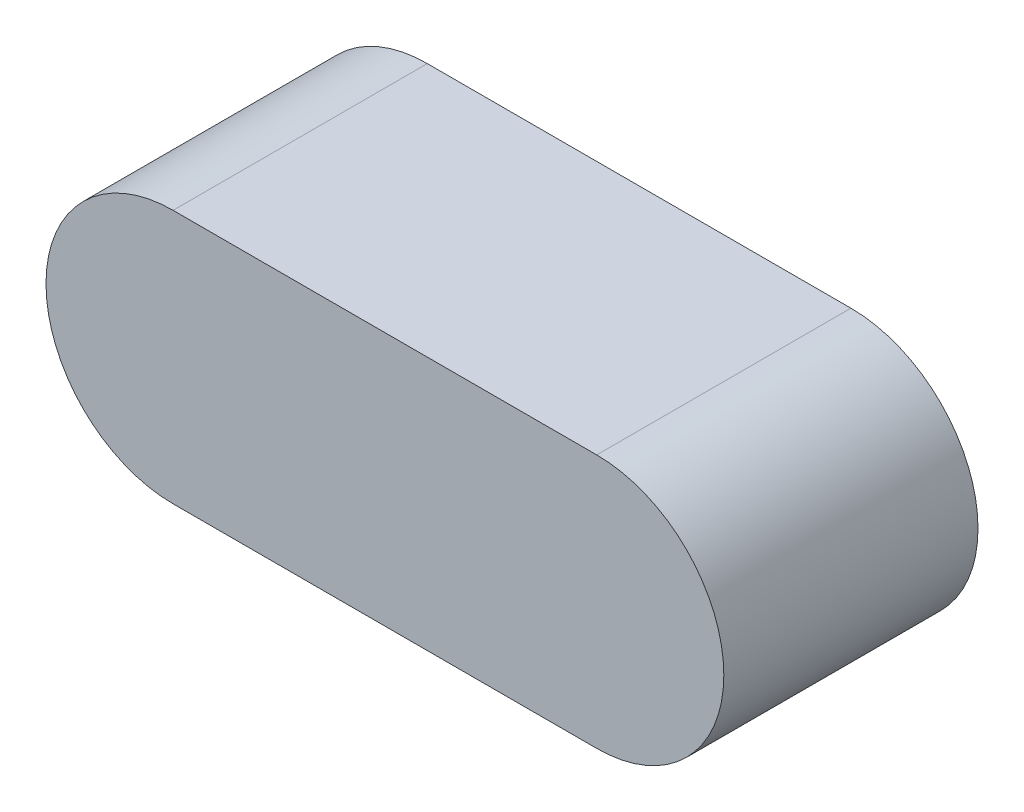
ISO-10303-21;
HEADER;
FILE_DESCRIPTION(('STEP AP214'),'2;1');
FILE_NAME('part.step','',(''),(''),'','','');
FILE_SCHEMA(('AUTOMOTIVE_DESIGN { 1 0 10303 214 1 1 1 1 }'));
ENDSEC;
DATA;
#1=APPLICATION_CONTEXT('core data for automotive mechanical design processes');
#2=APPLICATION_PROTOCOL_DEFINITION('international standard','automotive_design',2000,#1);
#3=PRODUCT_CONTEXT('',#1,'mechanical');
#4=PRODUCT('Part','Part','',(#3));
#5=PRODUCT_RELATED_PRODUCT_CATEGORY('part','',(#4));
#6=PRODUCT_DEFINITION_FORMATION('','',#4);
#7=PRODUCT_DEFINITION_CONTEXT('part definition',#1,'design');
#8=PRODUCT_DEFINITION('design','',#6,#7);
#9=PRODUCT_DEFINITION_SHAPE('','',#8);
#10=(LENGTH_UNIT() NAMED_UNIT(*) SI_UNIT(.MILLI.,.METRE.));
#11=(NAMED_UNIT(*) PLANE_ANGLE_UNIT() SI_UNIT($,.RADIAN.));
#12=(NAMED_UNIT(*) SI_UNIT($,.STERADIAN.) SOLID_ANGLE_UNIT());
#13=UNCERTAINTY_MEASURE_WITH_UNIT(LENGTH_MEASURE(1.E-05),#10,'distance_accuracy_value','');
#14=(GEOMETRIC_REPRESENTATION_CONTEXT(3) GLOBAL_UNCERTAINTY_ASSIGNED_CONTEXT((#13)) GLOBAL_UNIT_ASSIGNED_CONTEXT((#10,
#11,#12)) REPRESENTATION_CONTEXT('',''));
#15=CARTESIAN_POINT('',(0.,0.,0.));
#16=DIRECTION('',(0.,0.,1.));
#17=DIRECTION('',(1.,0.,0.));
#18=AXIS2_PLACEMENT_3D('',#15,#16,#17);
#19=CARTESIAN_POINT('',(0.,0.,6.));
#20=DIRECTION('',(0.,0.,-1.));
#21=DIRECTION('',(-1.,0.,0.));
#22=AXIS2_PLACEMENT_3D('',#19,#20,#21);
#23=CYLINDRICAL_SURFACE('',#22,3.);
#24=CARTESIAN_POINT('',(0.,0.,0.));
#25=DIRECTION('',(0.,0.,1.));
#26=DIRECTION('',(1.,0.,0.));
#27=AXIS2_PLACEMENT_3D('',#24,#25,#26);
#28=CIRCLE('',#27,3.);
#29=CARTESIAN_POINT('',(0.,3.,0.));
#30=VERTEX_POINT('',#29);
#31=CARTESIAN_POINT('',(0.,-3.,0.));
#32=VERTEX_POINT('',#31);
#33=EDGE_CURVE('E99',#30,#32,#28,.T.);
#34=ORIENTED_EDGE('',*,*,#33,.T.);
#35=DIRECTION('',(0.,0.,-1.));
#36=VECTOR('',#35,1.);
#37=CARTESIAN_POINT('',(0.,-3.,6.));
#38=LINE('',#37,#36);
#39=CARTESIAN_POINT('',(0.,-3.,6.));
#40=VERTEX_POINT('',#39);
#41=EDGE_CURVE('E11',#40,#32,#38,.T.);
#42=ORIENTED_EDGE('',*,*,#41,.F.);
#43=CARTESIAN_POINT('',(0.,0.,6.));
#44=DIRECTION('',(0.,0.,1.));
#45=DIRECTION('',(1.,0.,0.));
#46=AXIS2_PLACEMENT_3D('',#43,#44,#45);
#47=CIRCLE('',#46,3.);
#48=CARTESIAN_POINT('',(0.,3.,6.));
#49=VERTEX_POINT('',#48);
#50=EDGE_CURVE('E87',#49,#40,#47,.T.);
#51=ORIENTED_EDGE('',*,*,#50,.F.);
#52=DIRECTION('',(0.,0.,-1.));
#53=VECTOR('',#52,1.);
#54=CARTESIAN_POINT('',(0.,3.,6.));
#55=LINE('',#54,#53);
#56=EDGE_CURVE('E95',#49,#30,#55,.T.);
#57=ORIENTED_EDGE('',*,*,#56,.T.);
#58=EDGE_LOOP('',(#34,#42,#51,#57));
#59=FACE_BOUND('',#58,.T.);
#60=ADVANCED_FACE('F36',(#59),#23,.T.);
#61=CARTESIAN_POINT('',(0.,-3.,6.));
#62=DIRECTION('',(0.,1.,0.));
#63=DIRECTION('',(-1.,0.,0.));
#64=AXIS2_PLACEMENT_3D('',#61,#62,#63);
#65=PLANE('',#64);
#66=DIRECTION('',(1.,0.,0.));
#67=VECTOR('',#66,1.);
#68=CARTESIAN_POINT('',(0.,-3.,0.));
#69=LINE('',#68,#67);
#70=CARTESIAN_POINT('',(9.99999999999999,-3.,0.));
#71=VERTEX_POINT('',#70);
#72=EDGE_CURVE('E91',#32,#71,#69,.T.);
#73=ORIENTED_EDGE('',*,*,#72,.T.);
#74=DIRECTION('',(0.,0.,-1.));
#75=VECTOR('',#74,1.);
#76=CARTESIAN_POINT('',(9.99999999999999,-3.,6.));
#77=LINE('',#76,#75);
#78=CARTESIAN_POINT('',(9.99999999999999,-3.,6.));
#79=VERTEX_POINT('',#78);
#80=EDGE_CURVE('E44',#79,#71,#77,.T.);
#81=ORIENTED_EDGE('',*,*,#80,.F.);
#82=DIRECTION('',(1.,0.,0.));
#83=VECTOR('',#82,1.);
#84=CARTESIAN_POINT('',(0.,-3.,6.));
#85=LINE('',#84,#83);
#86=EDGE_CURVE('E82',#40,#79,#85,.T.);
#87=ORIENTED_EDGE('',*,*,#86,.F.);
#88=ORIENTED_EDGE('',*,*,#41,.T.);
#89=EDGE_LOOP('',(#73,#81,#87,#88));
#90=FACE_BOUND('',#89,.T.);
#91=ADVANCED_FACE('F90',(#90),#65,.F.);
#92=CARTESIAN_POINT('',(9.99999999999999,0.,6.));
#93=DIRECTION('',(0.,0.,-1.));
#94=DIRECTION('',(-1.,0.,0.));
#95=AXIS2_PLACEMENT_3D('',#92,#93,#94);
#96=CYLINDRICAL_SURFACE('',#95,3.);
#97=CARTESIAN_POINT('',(9.99999999999999,0.,0.));
#98=DIRECTION('',(0.,0.,1.));
#99=DIRECTION('',(1.,0.,0.));
#100=AXIS2_PLACEMENT_3D('',#97,#98,#99);
#101=CIRCLE('',#100,3.);
#102=CARTESIAN_POINT('',(9.99999999999999,3.,0.));
#103=VERTEX_POINT('',#102);
#104=EDGE_CURVE('E69',#71,#103,#101,.T.);
#105=ORIENTED_EDGE('',*,*,#104,.T.);
#106=DIRECTION('',(0.,0.,-1.));
#107=VECTOR('',#106,1.);
#108=CARTESIAN_POINT('',(9.99999999999999,3.,6.));
#109=LINE('',#108,#107);
#110=CARTESIAN_POINT('',(9.99999999999999,3.,6.));
#111=VERTEX_POINT('',#110);
#112=EDGE_CURVE('E92',#111,#103,#109,.T.);
#113=ORIENTED_EDGE('',*,*,#112,.F.);
#114=CARTESIAN_POINT('',(9.99999999999999,0.,6.));
#115=DIRECTION('',(0.,0.,1.));
#116=DIRECTION('',(1.,0.,0.));
#117=AXIS2_PLACEMENT_3D('',#114,#115,#116);
#118=CIRCLE('',#117,3.);
#119=EDGE_CURVE('E85',#79,#111,#118,.T.);
#120=ORIENTED_EDGE('',*,*,#119,.F.);
#121=ORIENTED_EDGE('',*,*,#80,.T.);
#122=EDGE_LOOP('',(#105,#113,#120,#121));
#123=FACE_BOUND('',#122,.T.);
#124=ADVANCED_FACE('F93',(#123),#96,.T.);
#125=CARTESIAN_POINT('',(0.,3.,6.));
#126=DIRECTION('',(0.,-1.,0.));
#127=DIRECTION('',(1.,0.,0.));
#128=AXIS2_PLACEMENT_3D('',#125,#126,#127);
#129=PLANE('',#128);
#130=DIRECTION('',(-1.,0.,0.));
#131=VECTOR('',#130,1.);
#132=CARTESIAN_POINT('',(0.,3.,0.));
#133=LINE('',#132,#131);
#134=EDGE_CURVE('E75',#103,#30,#133,.T.);
#135=ORIENTED_EDGE('',*,*,#134,.T.);
#136=ORIENTED_EDGE('',*,*,#56,.F.);
#137=DIRECTION('',(-1.,0.,0.));
#138=VECTOR('',#137,1.);
#139=CARTESIAN_POINT('',(0.,3.,6.));
#140=LINE('',#139,#138);
#141=EDGE_CURVE('E52',#111,#49,#140,.T.);
#142=ORIENTED_EDGE('',*,*,#141,.F.);
#143=ORIENTED_EDGE('',*,*,#112,.T.);
#144=EDGE_LOOP('',(#135,#136,#142,#143));
#145=FACE_BOUND('',#144,.T.);
#146=ADVANCED_FACE('F106',(#145),#129,.F.);
#147=CARTESIAN_POINT('',(0.,0.,6.));
#148=DIRECTION('',(0.,0.,1.));
#149=DIRECTION('',(1.,0.,0.));
#150=AXIS2_PLACEMENT_3D('',#147,#148,#149);
#151=PLANE('',#150);
#152=ORIENTED_EDGE('',*,*,#50,.T.);
#153=ORIENTED_EDGE('',*,*,#86,.T.);
#154=ORIENTED_EDGE('',*,*,#119,.T.);
#155=ORIENTED_EDGE('',*,*,#141,.T.);
#156=EDGE_LOOP('',(#152,#153,#154,#155));
#157=FACE_BOUND('',#156,.T.);
#158=ADVANCED_FACE('F83',(#157),#151,.T.);
#159=CARTESIAN_POINT('',(0.,0.,0.));
#160=DIRECTION('',(0.,0.,1.));
#161=DIRECTION('',(1.,0.,0.));
#162=AXIS2_PLACEMENT_3D('',#159,#160,#161);
#163=PLANE('',#162);
#164=ORIENTED_EDGE('',*,*,#33,.F.);
#165=ORIENTED_EDGE('',*,*,#134,.F.);
#166=ORIENTED_EDGE('',*,*,#104,.F.);
#167=ORIENTED_EDGE('',*,*,#72,.F.);
#168=EDGE_LOOP('',(#164,#165,#166,#167));
#169=FACE_BOUND('',#168,.T.);
#170=ADVANCED_FACE('F109',(#169),#163,.F.);
#171=CLOSED_SHELL('',(#60,#91,#124,#146,#158,#170));
#172=MANIFOLD_SOLID_BREP('B2',#171);
#173=ADVANCED_BREP_SHAPE_REPRESENTATION('',(#18,#172),#14);
#174=SHAPE_DEFINITION_REPRESENTATION(#9,#173);
ENDSEC;
END-ISO-10303-21;
